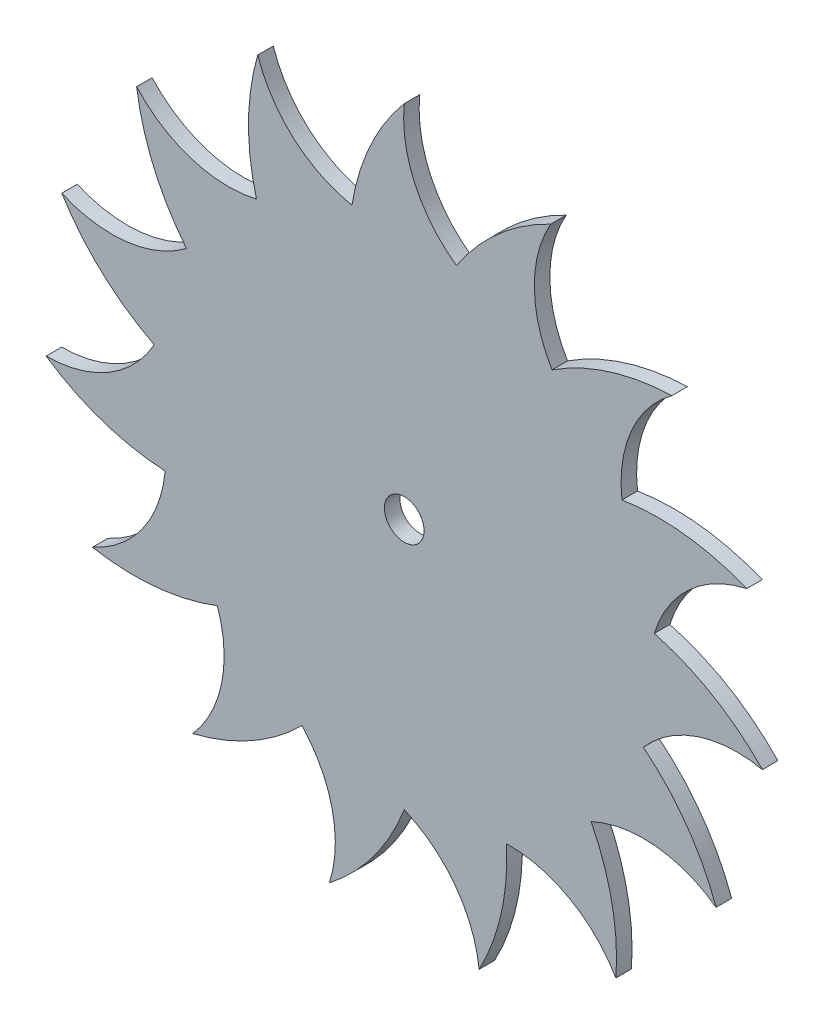
ISO-10303-21;
HEADER;
FILE_DESCRIPTION(('STEP AP214'),'2;1');
FILE_NAME('part.step','',(''),(''),'','','');
FILE_SCHEMA(('AUTOMOTIVE_DESIGN { 1 0 10303 214 1 1 1 1 }'));
ENDSEC;
DATA;
#1=APPLICATION_CONTEXT('core data for automotive mechanical design processes');
#2=APPLICATION_PROTOCOL_DEFINITION('international standard','automotive_design',2000,#1);
#3=PRODUCT_CONTEXT('',#1,'mechanical');
#4=PRODUCT('Part','Part','',(#3));
#5=PRODUCT_RELATED_PRODUCT_CATEGORY('part','',(#4));
#6=PRODUCT_DEFINITION_FORMATION('','',#4);
#7=PRODUCT_DEFINITION_CONTEXT('part definition',#1,'design');
#8=PRODUCT_DEFINITION('design','',#6,#7);
#9=PRODUCT_DEFINITION_SHAPE('','',#8);
#10=(LENGTH_UNIT() NAMED_UNIT(*) SI_UNIT(.MILLI.,.METRE.));
#11=(NAMED_UNIT(*) PLANE_ANGLE_UNIT() SI_UNIT($,.RADIAN.));
#12=(NAMED_UNIT(*) SI_UNIT($,.STERADIAN.) SOLID_ANGLE_UNIT());
#13=UNCERTAINTY_MEASURE_WITH_UNIT(LENGTH_MEASURE(1.E-05),#10,'distance_accuracy_value','');
#14=(GEOMETRIC_REPRESENTATION_CONTEXT(3) GLOBAL_UNCERTAINTY_ASSIGNED_CONTEXT((#13)) GLOBAL_UNIT_ASSIGNED_CONTEXT((#10,
#11,#12)) REPRESENTATION_CONTEXT('',''));
#15=CARTESIAN_POINT('',(0.,0.,0.));
#16=DIRECTION('',(0.,0.,1.));
#17=DIRECTION('',(1.,0.,0.));
#18=AXIS2_PLACEMENT_3D('',#15,#16,#17);
#19=CARTESIAN_POINT('',(161.658373530251,124.492132489692,-30.));
#20=DIRECTION('',(0.,0.,1.));
#21=DIRECTION('',(-1.,0.,0.));
#22=AXIS2_PLACEMENT_3D('',#19,#20,#21);
#23=PLANE('',#22);
#24=CARTESIAN_POINT('',(159.527531281903,76.8009026851546,-30.));
#25=DIRECTION('',(0.,0.,1.));
#26=DIRECTION('',(-1.,0.,0.));
#27=AXIS2_PLACEMENT_3D('',#24,#25,#26);
#28=CIRCLE('',#27,150.);
#29=CARTESIAN_POINT('',(94.3425643614318,211.896868900201,-30.));
#30=VERTEX_POINT('',#29);
#31=CARTESIAN_POINT('',(33.6712983279362,158.41100393884,-30.));
#32=VERTEX_POINT('',#31);
#33=EDGE_CURVE('E462',#30,#32,#28,.T.);
#34=ORIENTED_EDGE('',*,*,#33,.F.);
#35=CARTESIAN_POINT('',(163.789215778599,172.18336229423,-30.));
#36=DIRECTION('',(0.,0.,-1.));
#37=DIRECTION('',(-1.,0.,0.));
#38=AXIS2_PLACEMENT_3D('',#35,#36,#37);
#39=CIRCLE('',#38,80.);
#40=CARTESIAN_POINT('',(95.191821608766,131.020302239023,-30.));
#41=VERTEX_POINT('',#40);
#42=EDGE_CURVE('E279',#41,#30,#39,.T.);
#43=ORIENTED_EDGE('',*,*,#42,.F.);
#44=CARTESIAN_POINT('',(176.973392914872,5.27542323910336,-30.));
#45=DIRECTION('',(0.,0.,1.));
#46=DIRECTION('',(-1.,0.,0.));
#47=AXIS2_PLACEMENT_3D('',#44,#45,#46);
#48=CIRCLE('',#47,150.);
#49=CARTESIAN_POINT('',(172.372442269482,155.204844144937,-30.));
#50=VERTEX_POINT('',#49);
#51=EDGE_CURVE('E258',#50,#41,#48,.T.);
#52=ORIENTED_EDGE('',*,*,#51,.F.);
#53=CARTESIAN_POINT('',(219.662176858442,90.6782527077191,-30.));
#54=DIRECTION('',(0.,0.,-1.));
#55=DIRECTION('',(-1.,0.,0.));
#56=AXIS2_PLACEMENT_3D('',#53,#54,#55);
#57=CIRCLE('',#56,80.);
#58=CARTESIAN_POINT('',(140.25281414289,80.975,-30.));
#59=VERTEX_POINT('',#58);
#60=EDGE_CURVE('E269',#59,#50,#57,.T.);
#61=ORIENTED_EDGE('',*,*,#60,.F.);
#62=CARTESIAN_POINT('',(163.818947160057,-67.1622248107044,-30.));
#63=DIRECTION('',(0.,0.,1.));
#64=DIRECTION('',(-1.,0.,0.));
#65=AXIS2_PLACEMENT_3D('',#62,#63,#64);
#66=CIRCLE('',#65,150.);
#67=CARTESIAN_POINT('',(220.597558954661,71.6764918452691,-30.));
#68=VERTEX_POINT('',#67);
#69=EDGE_CURVE('E275',#68,#59,#66,.T.);
#70=ORIENTED_EDGE('',*,*,#69,.F.);
#71=CARTESIAN_POINT('',(237.553551991232,-6.50595055802087,-30.));
#72=DIRECTION('',(0.,0.,-1.));
#73=DIRECTION('',(-1.,0.,0.));
#74=AXIS2_PLACEMENT_3D('',#71,#72,#73);
#75=CIRCLE('',#74,80.0000000000001);
#76=CARTESIAN_POINT('',(161.062820954892,16.9283846261965,-30.));
#77=VERTEX_POINT('',#76);
#78=EDGE_CURVE('E560',#77,#68,#75,.T.);
#79=ORIENTED_EDGE('',*,*,#78,.F.);
#80=CARTESIAN_POINT('',(122.338717192855,-127.986914041084,-30.));
#81=DIRECTION('',(0.,0.,1.));
#82=DIRECTION('',(-1.,0.,0.));
#83=AXIS2_PLACEMENT_3D('',#80,#81,#82);
#84=CIRCLE('',#83,150.);
#85=CARTESIAN_POINT('',(230.679353630671,-24.2453770549322,-30.));
#86=VERTEX_POINT('',#85);
#87=EDGE_CURVE('E556',#86,#77,#84,.T.);
#88=ORIENTED_EDGE('',*,*,#87,.F.);
#89=CARTESIAN_POINT('',(214.369759878469,-102.565215867574,-30.));
#90=DIRECTION('',(0.,0.,-1.));
#91=DIRECTION('',(-1.,0.,0.));
#92=AXIS2_PLACEMENT_3D('',#89,#90,#91);
#93=CIRCLE('',#92,80.);
#94=CARTESIAN_POINT('',(154.023602814,-50.0453022390227,-30.));
#95=VERTEX_POINT('',#94);
#96=EDGE_CURVE('E552',#95,#86,#93,.T.);
#97=ORIENTED_EDGE('',*,*,#96,.F.);
#98=CARTESIAN_POINT('',(59.7050116106544,-166.681503109148,-30.));
#99=DIRECTION('',(0.,0.,1.));
#100=DIRECTION('',(-1.,0.,0.));
#101=AXIS2_PLACEMENT_3D('',#98,#99,#100);
#102=CIRCLE('',#101,150.);
#103=CARTESIAN_POINT('',(200.874592407801,-115.975,-30.));
#104=VERTEX_POINT('',#103);
#105=EDGE_CURVE('E548',#104,#95,#102,.T.);
#106=ORIENTED_EDGE('',*,*,#105,.F.);
#107=CARTESIAN_POINT('',(154.119488794589,-180.890023577889,-30.));
#108=DIRECTION('',(0.,0.,-1.));
#109=DIRECTION('',(-1.,0.,0.));
#110=AXIS2_PLACEMENT_3D('',#107,#108,#109);
#111=CIRCLE('',#110,80.0000000000001);
#112=CARTESIAN_POINT('',(120.352304486064,-108.365701699817,-30.));
#113=VERTEX_POINT('',#112);
#114=EDGE_CURVE('E544',#113,#104,#111,.T.);
#115=ORIENTED_EDGE('',*,*,#114,.F.);
#116=CARTESIAN_POINT('',(-13.2522328820312,-176.555346035722,-30.));
#117=DIRECTION('',(0.,0.,1.));
#118=DIRECTION('',(-1.,0.,0.));
#119=AXIS2_PLACEMENT_3D('',#116,#117,#118);
#120=CIRCLE('',#119,150.);
#121=CARTESIAN_POINT('',(136.336789269239,-187.651491845269,-30.));
#122=VERTEX_POINT('',#121);
#123=EDGE_CURVE('E540',#122,#113,#120,.T.);
#124=ORIENTED_EDGE('',*,*,#123,.F.);
#125=CARTESIAN_POINT('',(67.2205579665236,-227.937302877313,-30.));
#126=DIRECTION('',(0.,0.,-1.));
#127=DIRECTION('',(-1.,0.,0.));
#128=AXIS2_PLACEMENT_3D('',#125,#126,#127);
#129=CIRCLE('',#128,80.0000000000001);
#130=CARTESIAN_POINT('',(65.8709993461259,-147.948686865219,-30.));
#131=VERTEX_POINT('',#130);
#132=EDGE_CURVE('E536',#131,#122,#129,.T.);
#133=ORIENTED_EDGE('',*,*,#132,.F.);
#134=CARTESIAN_POINT('',(-83.9180459166574,-155.901165677756,-30.));
#135=DIRECTION('',(0.,0.,1.));
#136=DIRECTION('',(-1.,0.,0.));
#137=AXIS2_PLACEMENT_3D('',#134,#135,#136);
#138=CIRCLE('',#137,150.);
#139=CARTESIAN_POINT('',(48.2251166851794,-226.881335990206,-30.));
#140=VERTEX_POINT('',#139);
#141=EDGE_CURVE('E532',#140,#131,#138,.T.);
#142=ORIENTED_EDGE('',*,*,#141,.F.);
#143=CARTESIAN_POINT('',(-31.3014180135512,-235.572151763861,-30.));
#144=DIRECTION('',(0.,0.,-1.));
#145=DIRECTION('',(-1.,0.,0.));
#146=AXIS2_PLACEMENT_3D('',#143,#144,#145);
#147=CIRCLE('',#146,80.);
#148=CARTESIAN_POINT('',(0.,-161.95,-30.));
#149=VERTEX_POINT('',#148);
#150=EDGE_CURVE('E528',#149,#140,#147,.T.);
#151=ORIENTED_EDGE('',*,*,#150,.F.);
#152=CARTESIAN_POINT('',(-140.07366644078,-108.290257456478,-30.));
#153=DIRECTION('',(0.,0.,1.));
#154=DIRECTION('',(-1.,0.,0.));
#155=AXIS2_PLACEMENT_3D('',#152,#153,#154);
#156=CIRCLE('',#155,150.);
#157=CARTESIAN_POINT('',(-48.2251166851792,-226.881335990206,-30.));
#158=VERTEX_POINT('',#157);
#159=EDGE_CURVE('E524',#158,#149,#156,.T.);
#160=ORIENTED_EDGE('',*,*,#159,.F.);
#161=CARTESIAN_POINT('',(-124.411094454628,-202.474435504624,-30.));
#162=DIRECTION('',(0.,0.,-1.));
#163=DIRECTION('',(-1.,0.,0.));
#164=AXIS2_PLACEMENT_3D('',#161,#162,#163);
#165=CIRCLE('',#164,80.);
#166=CARTESIAN_POINT('',(-65.8709993461258,-147.948686865219,-30.));
#167=VERTEX_POINT('',#166);
#168=EDGE_CURVE('E520',#167,#158,#165,.T.);
#169=ORIENTED_EDGE('',*,*,#168,.F.);
#170=CARTESIAN_POINT('',(-172.009277507981,-41.9549799348709,-30.));
#171=DIRECTION('',(0.,0.,1.));
#172=DIRECTION('',(-1.,0.,0.));
#173=AXIS2_PLACEMENT_3D('',#170,#171,#172);
#174=CIRCLE('',#173,150.);
#175=CARTESIAN_POINT('',(-136.336789269239,-187.651491845269,-30.));
#176=VERTEX_POINT('',#175);
#177=EDGE_CURVE('E516',#176,#167,#174,.T.);
#178=ORIENTED_EDGE('',*,*,#177,.F.);
#179=CARTESIAN_POINT('',(-196.008962425188,-134.367049924138,-30.));
#180=DIRECTION('',(0.,0.,-1.));
#181=DIRECTION('',(-1.,0.,0.));
#182=AXIS2_PLACEMENT_3D('',#179,#180,#181);
#183=CIRCLE('',#182,80.0000000000001);
#184=CARTESIAN_POINT('',(-120.352304486064,-108.365701699817,-30.));
#185=VERTEX_POINT('',#184);
#186=EDGE_CURVE('E512',#185,#176,#183,.T.);
#187=ORIENTED_EDGE('',*,*,#186,.F.);
#188=CARTESIAN_POINT('',(-174.202921838824,31.6346947665022,-30.));
#189=DIRECTION('',(0.,0.,1.));
#190=DIRECTION('',(-1.,0.,0.));
#191=AXIS2_PLACEMENT_3D('',#188,#189,#190);
#192=CIRCLE('',#191,150.);
#193=CARTESIAN_POINT('',(-200.8745924078,-115.975,-30.));
#194=VERTEX_POINT('',#193);
#195=EDGE_CURVE('E508',#194,#185,#192,.T.);
#196=ORIENTED_EDGE('',*,*,#195,.F.);
#197=CARTESIAN_POINT('',(-233.715100106912,-43.0263807254408,-30.));
#198=DIRECTION('',(0.,0.,-1.));
#199=DIRECTION('',(-1.,0.,0.));
#200=AXIS2_PLACEMENT_3D('',#197,#198,#199);
#201=CIRCLE('',#200,80.);
#202=CARTESIAN_POINT('',(-154.023602814,-50.0453022390228,-30.));
#203=VERTEX_POINT('',#202);
#204=EDGE_CURVE('E504',#203,#194,#201,.T.);
#205=ORIENTED_EDGE('',*,*,#204,.F.);
#206=CARTESIAN_POINT('',(-146.275298399872,99.7544433505675,-30.));
#207=DIRECTION('',(0.,0.,1.));
#208=DIRECTION('',(-1.,0.,0.));
#209=AXIS2_PLACEMENT_3D('',#206,#207,#208);
#210=CIRCLE('',#209,150.);
#211=CARTESIAN_POINT('',(-230.679353630671,-24.2453770549324,-30.));
#212=VERTEX_POINT('',#211);
#213=EDGE_CURVE('E500',#212,#203,#210,.T.);
#214=ORIENTED_EDGE('',*,*,#213,.F.);
#215=CARTESIAN_POINT('',(-231.009773745122,55.7539405830823,-30.));
#216=DIRECTION('',(0.,0.,-1.));
#217=DIRECTION('',(-1.,0.,0.));
#218=AXIS2_PLACEMENT_3D('',#215,#216,#217);
#219=CIRCLE('',#218,80.);
#220=CARTESIAN_POINT('',(-161.062820954892,16.9283846261964,-30.));
#221=VERTEX_POINT('',#220);
#222=EDGE_CURVE('E496',#221,#212,#219,.T.);
#223=ORIENTED_EDGE('',*,*,#222,.F.);
#224=CARTESIAN_POINT('',(-93.0553469982141,150.625742438652,-30.));
#225=DIRECTION('',(0.,0.,1.));
#226=DIRECTION('',(-1.,0.,0.));
#227=AXIS2_PLACEMENT_3D('',#224,#225,#226);
#228=CIRCLE('',#227,150.);
#229=CARTESIAN_POINT('',(-220.597558954661,71.676491845269,-30.));
#230=VERTEX_POINT('',#229);
#231=EDGE_CURVE('E492',#230,#221,#228,.T.);
#232=ORIENTED_EDGE('',*,*,#231,.F.);
#233=CARTESIAN_POINT('',(-188.360758844891,144.893899056142,-30.));
#234=DIRECTION('',(0.,0.,-1.));
#235=DIRECTION('',(-1.,0.,0.));
#236=AXIS2_PLACEMENT_3D('',#233,#234,#235);
#237=CIRCLE('',#236,80.0000000000001);
#238=CARTESIAN_POINT('',(-140.25281414289,80.975,-30.));
#239=VERTEX_POINT('',#238);
#240=EDGE_CURVE('E488',#239,#230,#237,.T.);
#241=ORIENTED_EDGE('',*,*,#240,.F.);
#242=CARTESIAN_POINT('',(-23.7452807192772,175.452482267182,-30.));
#243=DIRECTION('',(0.,0.,1.));
#244=DIRECTION('',(-1.,0.,0.));
#245=AXIS2_PLACEMENT_3D('',#242,#243,#244);
#246=CIRCLE('',#245,150.);
#247=CARTESIAN_POINT('',(-172.372442269482,155.204844144937,-30.));
#248=VERTEX_POINT('',#247);
#249=EDGE_CURVE('E484',#248,#239,#246,.T.);
#250=ORIENTED_EDGE('',*,*,#249,.F.);
#251=CARTESIAN_POINT('',(-113.142457536605,208.980386062645,-30.));
#252=DIRECTION('',(0.,0.,-1.));
#253=DIRECTION('',(-1.,0.,0.));
#254=AXIS2_PLACEMENT_3D('',#251,#252,#253);
#255=CIRCLE('',#254,80.0000000000001);
#256=CARTESIAN_POINT('',(-95.1918216087661,131.020302239023,-30.));
#257=VERTEX_POINT('',#256);
#258=EDGE_CURVE('E480',#257,#248,#255,.T.);
#259=ORIENTED_EDGE('',*,*,#258,.F.);
#260=CARTESIAN_POINT('',(49.670560315126,169.941893975955,-30.));
#261=DIRECTION('',(0.,0.,1.));
#262=DIRECTION('',(-1.,0.,0.));
#263=AXIS2_PLACEMENT_3D('',#260,#261,#262);
#264=CIRCLE('',#263,150.);
#265=CARTESIAN_POINT('',(-94.342564361432,211.896868900201,-30.));
#266=VERTEX_POINT('',#265);
#267=EDGE_CURVE('E476',#266,#257,#264,.T.);
#268=ORIENTED_EDGE('',*,*,#267,.F.);
#269=CARTESIAN_POINT('',(-18.360797453281,236.932265791711,-30.));
#270=DIRECTION('',(0.,0.,-1.));
#271=DIRECTION('',(-1.,0.,0.));
#272=AXIS2_PLACEMENT_3D('',#269,#270,#271);
#273=CIRCLE('',#272,80.0000000000001);
#274=CARTESIAN_POINT('',(-33.6712983279361,158.41100393884,-30.));
#275=VERTEX_POINT('',#274);
#276=EDGE_CURVE('E472',#275,#266,#273,.T.);
#277=ORIENTED_EDGE('',*,*,#276,.F.);
#278=CARTESIAN_POINT('',(114.49791022817,135.046808342645,-30.));
#279=DIRECTION('',(0.,0.,1.));
#280=DIRECTION('',(-1.,0.,0.));
#281=AXIS2_PLACEMENT_3D('',#278,#279,#280);
#282=CIRCLE('',#281,150.);
#283=CARTESIAN_POINT('',(0.,231.95,-30.));
#284=VERTEX_POINT('',#283);
#285=EDGE_CURVE('E468',#284,#275,#282,.T.);
#286=ORIENTED_EDGE('',*,*,#285,.F.);
#287=CARTESIAN_POINT('',(79.5956113123232,223.916404303329,-30.));
#288=DIRECTION('',(0.,0.,-1.));
#289=DIRECTION('',(-1.,0.,0.));
#290=AXIS2_PLACEMENT_3D('',#287,#288,#289);
#291=CIRCLE('',#290,80.);
#292=EDGE_CURVE('E465',#32,#284,#291,.T.);
#293=ORIENTED_EDGE('',*,*,#292,.F.);
#294=EDGE_LOOP('',(#34,#43,#52,#61,#70,#79,#88,#97,#106,#115,#124,#133,#142,#151,#160,#169,#178,
#187,#196,#205,#214,#223,#232,#241,#250,#259,#268,#277,#286,#293));
#295=FACE_BOUND('',#294,.T.);
#296=CARTESIAN_POINT('',(0.,0.,-30.));
#297=DIRECTION('',(0.,0.,1.));
#298=DIRECTION('',(1.,0.,0.));
#299=AXIS2_PLACEMENT_3D('',#296,#297,#298);
#300=CIRCLE('',#299,12.75);
#301=CARTESIAN_POINT('',(12.75,0.,-30.));
#302=VERTEX_POINT('',#301);
#303=EDGE_CURVE('E293',#302,#302,#300,.T.);
#304=ORIENTED_EDGE('',*,*,#303,.T.);
#305=EDGE_LOOP('',(#304));
#306=FACE_BOUND('',#305,.T.);
#307=ADVANCED_FACE('F52',(#295,#306),#23,.F.);
#308=CARTESIAN_POINT('',(161.658373530251,124.492132489692,-20.));
#309=DIRECTION('',(0.,0.,1.));
#310=DIRECTION('',(-1.,0.,0.));
#311=AXIS2_PLACEMENT_3D('',#308,#309,#310);
#312=PLANE('',#311);
#313=CARTESIAN_POINT('',(159.527531281903,76.8009026851546,-20.));
#314=DIRECTION('',(0.,0.,1.));
#315=DIRECTION('',(-1.,0.,0.));
#316=AXIS2_PLACEMENT_3D('',#313,#314,#315);
#317=CIRCLE('',#316,150.);
#318=CARTESIAN_POINT('',(94.3425643614318,211.896868900201,-20.));
#319=VERTEX_POINT('',#318);
#320=CARTESIAN_POINT('',(33.6712983279362,158.41100393884,-20.));
#321=VERTEX_POINT('',#320);
#322=EDGE_CURVE('E287',#319,#321,#317,.T.);
#323=ORIENTED_EDGE('',*,*,#322,.T.);
#324=CARTESIAN_POINT('',(79.5956113123232,223.916404303329,-20.));
#325=DIRECTION('',(0.,0.,-1.));
#326=DIRECTION('',(-1.,0.,0.));
#327=AXIS2_PLACEMENT_3D('',#324,#325,#326);
#328=CIRCLE('',#327,80.);
#329=CARTESIAN_POINT('',(0.,231.95,-20.));
#330=VERTEX_POINT('',#329);
#331=EDGE_CURVE('E292',#321,#330,#328,.T.);
#332=ORIENTED_EDGE('',*,*,#331,.T.);
#333=CARTESIAN_POINT('',(114.49791022817,135.046808342645,-20.));
#334=DIRECTION('',(0.,0.,1.));
#335=DIRECTION('',(-1.,0.,0.));
#336=AXIS2_PLACEMENT_3D('',#333,#334,#335);
#337=CIRCLE('',#336,150.);
#338=CARTESIAN_POINT('',(-33.6712983279361,158.41100393884,-20.));
#339=VERTEX_POINT('',#338);
#340=EDGE_CURVE('E302',#330,#339,#337,.T.);
#341=ORIENTED_EDGE('',*,*,#340,.T.);
#342=CARTESIAN_POINT('',(-18.360797453281,236.932265791711,-20.));
#343=DIRECTION('',(0.,0.,-1.));
#344=DIRECTION('',(-1.,0.,0.));
#345=AXIS2_PLACEMENT_3D('',#342,#343,#344);
#346=CIRCLE('',#345,80.0000000000001);
#347=CARTESIAN_POINT('',(-94.342564361432,211.896868900201,-20.));
#348=VERTEX_POINT('',#347);
#349=EDGE_CURVE('E306',#339,#348,#346,.T.);
#350=ORIENTED_EDGE('',*,*,#349,.T.);
#351=CARTESIAN_POINT('',(49.670560315126,169.941893975955,-20.));
#352=DIRECTION('',(0.,0.,1.));
#353=DIRECTION('',(-1.,0.,0.));
#354=AXIS2_PLACEMENT_3D('',#351,#352,#353);
#355=CIRCLE('',#354,150.);
#356=CARTESIAN_POINT('',(-95.1918216087661,131.020302239023,-20.));
#357=VERTEX_POINT('',#356);
#358=EDGE_CURVE('E311',#348,#357,#355,.T.);
#359=ORIENTED_EDGE('',*,*,#358,.T.);
#360=CARTESIAN_POINT('',(-113.142457536605,208.980386062645,-20.));
#361=DIRECTION('',(0.,0.,-1.));
#362=DIRECTION('',(-1.,0.,0.));
#363=AXIS2_PLACEMENT_3D('',#360,#361,#362);
#364=CIRCLE('',#363,80.0000000000001);
#365=CARTESIAN_POINT('',(-172.372442269482,155.204844144937,-20.));
#366=VERTEX_POINT('',#365);
#367=EDGE_CURVE('E316',#357,#366,#364,.T.);
#368=ORIENTED_EDGE('',*,*,#367,.T.);
#369=CARTESIAN_POINT('',(-23.7452807192772,175.452482267182,-20.));
#370=DIRECTION('',(0.,0.,1.));
#371=DIRECTION('',(-1.,0.,0.));
#372=AXIS2_PLACEMENT_3D('',#369,#370,#371);
#373=CIRCLE('',#372,150.);
#374=CARTESIAN_POINT('',(-140.25281414289,80.975,-20.));
#375=VERTEX_POINT('',#374);
#376=EDGE_CURVE('E324',#366,#375,#373,.T.);
#377=ORIENTED_EDGE('',*,*,#376,.T.);
#378=CARTESIAN_POINT('',(-188.360758844891,144.893899056142,-20.));
#379=DIRECTION('',(0.,0.,-1.));
#380=DIRECTION('',(-1.,0.,0.));
#381=AXIS2_PLACEMENT_3D('',#378,#379,#380);
#382=CIRCLE('',#381,80.0000000000001);
#383=CARTESIAN_POINT('',(-220.597558954661,71.676491845269,-20.));
#384=VERTEX_POINT('',#383);
#385=EDGE_CURVE('E328',#375,#384,#382,.T.);
#386=ORIENTED_EDGE('',*,*,#385,.T.);
#387=CARTESIAN_POINT('',(-93.0553469982141,150.625742438652,-20.));
#388=DIRECTION('',(0.,0.,1.));
#389=DIRECTION('',(-1.,0.,0.));
#390=AXIS2_PLACEMENT_3D('',#387,#388,#389);
#391=CIRCLE('',#390,150.);
#392=CARTESIAN_POINT('',(-161.062820954892,16.9283846261964,-20.));
#393=VERTEX_POINT('',#392);
#394=EDGE_CURVE('E333',#384,#393,#391,.T.);
#395=ORIENTED_EDGE('',*,*,#394,.T.);
#396=CARTESIAN_POINT('',(-231.009773745122,55.7539405830823,-20.));
#397=DIRECTION('',(0.,0.,-1.));
#398=DIRECTION('',(-1.,0.,0.));
#399=AXIS2_PLACEMENT_3D('',#396,#397,#398);
#400=CIRCLE('',#399,80.);
#401=CARTESIAN_POINT('',(-230.679353630671,-24.2453770549324,-20.));
#402=VERTEX_POINT('',#401);
#403=EDGE_CURVE('E338',#393,#402,#400,.T.);
#404=ORIENTED_EDGE('',*,*,#403,.T.);
#405=CARTESIAN_POINT('',(-146.275298399872,99.7544433505675,-20.));
#406=DIRECTION('',(0.,0.,1.));
#407=DIRECTION('',(-1.,0.,0.));
#408=AXIS2_PLACEMENT_3D('',#405,#406,#407);
#409=CIRCLE('',#408,150.);
#410=CARTESIAN_POINT('',(-154.023602814,-50.0453022390228,-20.));
#411=VERTEX_POINT('',#410);
#412=EDGE_CURVE('E346',#402,#411,#409,.T.);
#413=ORIENTED_EDGE('',*,*,#412,.T.);
#414=CARTESIAN_POINT('',(-233.715100106912,-43.0263807254408,-20.));
#415=DIRECTION('',(0.,0.,-1.));
#416=DIRECTION('',(-1.,0.,0.));
#417=AXIS2_PLACEMENT_3D('',#414,#415,#416);
#418=CIRCLE('',#417,80.);
#419=CARTESIAN_POINT('',(-200.8745924078,-115.975,-20.));
#420=VERTEX_POINT('',#419);
#421=EDGE_CURVE('E350',#411,#420,#418,.T.);
#422=ORIENTED_EDGE('',*,*,#421,.T.);
#423=CARTESIAN_POINT('',(-174.202921838824,31.6346947665022,-20.));
#424=DIRECTION('',(0.,0.,1.));
#425=DIRECTION('',(-1.,0.,0.));
#426=AXIS2_PLACEMENT_3D('',#423,#424,#425);
#427=CIRCLE('',#426,150.);
#428=CARTESIAN_POINT('',(-120.352304486064,-108.365701699817,-20.));
#429=VERTEX_POINT('',#428);
#430=EDGE_CURVE('E355',#420,#429,#427,.T.);
#431=ORIENTED_EDGE('',*,*,#430,.T.);
#432=CARTESIAN_POINT('',(-196.008962425188,-134.367049924138,-20.));
#433=DIRECTION('',(0.,0.,-1.));
#434=DIRECTION('',(-1.,0.,0.));
#435=AXIS2_PLACEMENT_3D('',#432,#433,#434);
#436=CIRCLE('',#435,80.0000000000001);
#437=CARTESIAN_POINT('',(-136.336789269239,-187.651491845269,-20.));
#438=VERTEX_POINT('',#437);
#439=EDGE_CURVE('E360',#429,#438,#436,.T.);
#440=ORIENTED_EDGE('',*,*,#439,.T.);
#441=CARTESIAN_POINT('',(-172.009277507981,-41.9549799348709,-20.));
#442=DIRECTION('',(0.,0.,1.));
#443=DIRECTION('',(-1.,0.,0.));
#444=AXIS2_PLACEMENT_3D('',#441,#442,#443);
#445=CIRCLE('',#444,150.);
#446=CARTESIAN_POINT('',(-65.8709993461258,-147.948686865219,-20.));
#447=VERTEX_POINT('',#446);
#448=EDGE_CURVE('E368',#438,#447,#445,.T.);
#449=ORIENTED_EDGE('',*,*,#448,.T.);
#450=CARTESIAN_POINT('',(-124.411094454628,-202.474435504624,-20.));
#451=DIRECTION('',(0.,0.,-1.));
#452=DIRECTION('',(-1.,0.,0.));
#453=AXIS2_PLACEMENT_3D('',#450,#451,#452);
#454=CIRCLE('',#453,80.);
#455=CARTESIAN_POINT('',(-48.2251166851792,-226.881335990206,-20.));
#456=VERTEX_POINT('',#455);
#457=EDGE_CURVE('E372',#447,#456,#454,.T.);
#458=ORIENTED_EDGE('',*,*,#457,.T.);
#459=CARTESIAN_POINT('',(-140.07366644078,-108.290257456478,-20.));
#460=DIRECTION('',(0.,0.,1.));
#461=DIRECTION('',(-1.,0.,0.));
#462=AXIS2_PLACEMENT_3D('',#459,#460,#461);
#463=CIRCLE('',#462,150.);
#464=CARTESIAN_POINT('',(0.,-161.95,-20.));
#465=VERTEX_POINT('',#464);
#466=EDGE_CURVE('E377',#456,#465,#463,.T.);
#467=ORIENTED_EDGE('',*,*,#466,.T.);
#468=CARTESIAN_POINT('',(-31.3014180135512,-235.572151763861,-20.));
#469=DIRECTION('',(0.,0.,-1.));
#470=DIRECTION('',(-1.,0.,0.));
#471=AXIS2_PLACEMENT_3D('',#468,#469,#470);
#472=CIRCLE('',#471,80.);
#473=CARTESIAN_POINT('',(48.2251166851794,-226.881335990206,-20.));
#474=VERTEX_POINT('',#473);
#475=EDGE_CURVE('E382',#465,#474,#472,.T.);
#476=ORIENTED_EDGE('',*,*,#475,.T.);
#477=CARTESIAN_POINT('',(-83.9180459166574,-155.901165677756,-20.));
#478=DIRECTION('',(0.,0.,1.));
#479=DIRECTION('',(-1.,0.,0.));
#480=AXIS2_PLACEMENT_3D('',#477,#478,#479);
#481=CIRCLE('',#480,150.);
#482=CARTESIAN_POINT('',(65.8709993461259,-147.948686865219,-20.));
#483=VERTEX_POINT('',#482);
#484=EDGE_CURVE('E390',#474,#483,#481,.T.);
#485=ORIENTED_EDGE('',*,*,#484,.T.);
#486=CARTESIAN_POINT('',(67.2205579665236,-227.937302877313,-20.));
#487=DIRECTION('',(0.,0.,-1.));
#488=DIRECTION('',(-1.,0.,0.));
#489=AXIS2_PLACEMENT_3D('',#486,#487,#488);
#490=CIRCLE('',#489,80.0000000000001);
#491=CARTESIAN_POINT('',(136.336789269239,-187.651491845269,-20.));
#492=VERTEX_POINT('',#491);
#493=EDGE_CURVE('E394',#483,#492,#490,.T.);
#494=ORIENTED_EDGE('',*,*,#493,.T.);
#495=CARTESIAN_POINT('',(-13.2522328820312,-176.555346035722,-20.));
#496=DIRECTION('',(0.,0.,1.));
#497=DIRECTION('',(-1.,0.,0.));
#498=AXIS2_PLACEMENT_3D('',#495,#496,#497);
#499=CIRCLE('',#498,150.);
#500=CARTESIAN_POINT('',(120.352304486064,-108.365701699817,-20.));
#501=VERTEX_POINT('',#500);
#502=EDGE_CURVE('E399',#492,#501,#499,.T.);
#503=ORIENTED_EDGE('',*,*,#502,.T.);
#504=CARTESIAN_POINT('',(154.119488794589,-180.890023577889,-20.));
#505=DIRECTION('',(0.,0.,-1.));
#506=DIRECTION('',(-1.,0.,0.));
#507=AXIS2_PLACEMENT_3D('',#504,#505,#506);
#508=CIRCLE('',#507,80.0000000000001);
#509=CARTESIAN_POINT('',(200.874592407801,-115.975,-20.));
#510=VERTEX_POINT('',#509);
#511=EDGE_CURVE('E404',#501,#510,#508,.T.);
#512=ORIENTED_EDGE('',*,*,#511,.T.);
#513=CARTESIAN_POINT('',(59.7050116106544,-166.681503109148,-20.));
#514=DIRECTION('',(0.,0.,1.));
#515=DIRECTION('',(-1.,0.,0.));
#516=AXIS2_PLACEMENT_3D('',#513,#514,#515);
#517=CIRCLE('',#516,150.);
#518=CARTESIAN_POINT('',(154.023602814,-50.0453022390227,-20.));
#519=VERTEX_POINT('',#518);
#520=EDGE_CURVE('E412',#510,#519,#517,.T.);
#521=ORIENTED_EDGE('',*,*,#520,.T.);
#522=CARTESIAN_POINT('',(214.369759878469,-102.565215867574,-20.));
#523=DIRECTION('',(0.,0.,-1.));
#524=DIRECTION('',(-1.,0.,0.));
#525=AXIS2_PLACEMENT_3D('',#522,#523,#524);
#526=CIRCLE('',#525,80.);
#527=CARTESIAN_POINT('',(230.679353630671,-24.2453770549322,-20.));
#528=VERTEX_POINT('',#527);
#529=EDGE_CURVE('E416',#519,#528,#526,.T.);
#530=ORIENTED_EDGE('',*,*,#529,.T.);
#531=CARTESIAN_POINT('',(122.338717192855,-127.986914041084,-20.));
#532=DIRECTION('',(0.,0.,1.));
#533=DIRECTION('',(-1.,0.,0.));
#534=AXIS2_PLACEMENT_3D('',#531,#532,#533);
#535=CIRCLE('',#534,150.);
#536=CARTESIAN_POINT('',(161.062820954892,16.9283846261965,-20.));
#537=VERTEX_POINT('',#536);
#538=EDGE_CURVE('E421',#528,#537,#535,.T.);
#539=ORIENTED_EDGE('',*,*,#538,.T.);
#540=CARTESIAN_POINT('',(237.553551991232,-6.50595055802087,-20.));
#541=DIRECTION('',(0.,0.,-1.));
#542=DIRECTION('',(-1.,0.,0.));
#543=AXIS2_PLACEMENT_3D('',#540,#541,#542);
#544=CIRCLE('',#543,80.0000000000001);
#545=CARTESIAN_POINT('',(220.597558954661,71.6764918452691,-20.));
#546=VERTEX_POINT('',#545);
#547=EDGE_CURVE('E426',#537,#546,#544,.T.);
#548=ORIENTED_EDGE('',*,*,#547,.T.);
#549=CARTESIAN_POINT('',(163.818947160057,-67.1622248107044,-20.));
#550=DIRECTION('',(0.,0.,1.));
#551=DIRECTION('',(-1.,0.,0.));
#552=AXIS2_PLACEMENT_3D('',#549,#550,#551);
#553=CIRCLE('',#552,150.);
#554=CARTESIAN_POINT('',(140.25281414289,80.975,-20.));
#555=VERTEX_POINT('',#554);
#556=EDGE_CURVE('E434',#546,#555,#553,.T.);
#557=ORIENTED_EDGE('',*,*,#556,.T.);
#558=CARTESIAN_POINT('',(219.662176858442,90.6782527077191,-20.));
#559=DIRECTION('',(0.,0.,-1.));
#560=DIRECTION('',(-1.,0.,0.));
#561=AXIS2_PLACEMENT_3D('',#558,#559,#560);
#562=CIRCLE('',#561,80.);
#563=CARTESIAN_POINT('',(172.372442269482,155.204844144937,-20.));
#564=VERTEX_POINT('',#563);
#565=EDGE_CURVE('E438',#555,#564,#562,.T.);
#566=ORIENTED_EDGE('',*,*,#565,.T.);
#567=CARTESIAN_POINT('',(176.973392914872,5.27542323910336,-20.));
#568=DIRECTION('',(0.,0.,1.));
#569=DIRECTION('',(-1.,0.,0.));
#570=AXIS2_PLACEMENT_3D('',#567,#568,#569);
#571=CIRCLE('',#570,150.);
#572=CARTESIAN_POINT('',(95.191821608766,131.020302239023,-20.));
#573=VERTEX_POINT('',#572);
#574=EDGE_CURVE('E261',#564,#573,#571,.T.);
#575=ORIENTED_EDGE('',*,*,#574,.T.);
#576=CARTESIAN_POINT('',(163.789215778599,172.18336229423,-20.));
#577=DIRECTION('',(0.,0.,-1.));
#578=DIRECTION('',(-1.,0.,0.));
#579=AXIS2_PLACEMENT_3D('',#576,#577,#578);
#580=CIRCLE('',#579,80.);
#581=EDGE_CURVE('E445',#573,#319,#580,.T.);
#582=ORIENTED_EDGE('',*,*,#581,.T.);
#583=EDGE_LOOP('',(#323,#332,#341,#350,#359,#368,#377,#386,#395,#404,#413,#422,#431,#440,#449,
#458,#467,#476,#485,#494,#503,#512,#521,#530,#539,#548,#557,#566,#575,#582));
#584=FACE_BOUND('',#583,.T.);
#585=CARTESIAN_POINT('',(0.,0.,-20.));
#586=DIRECTION('',(0.,0.,1.));
#587=DIRECTION('',(1.,0.,0.));
#588=AXIS2_PLACEMENT_3D('',#585,#586,#587);
#589=CIRCLE('',#588,12.75);
#590=CARTESIAN_POINT('',(12.75,0.,-20.));
#591=VERTEX_POINT('',#590);
#592=EDGE_CURVE('E456',#591,#591,#589,.T.);
#593=ORIENTED_EDGE('',*,*,#592,.F.);
#594=EDGE_LOOP('',(#593));
#595=FACE_BOUND('',#594,.T.);
#596=ADVANCED_FACE('F730',(#584,#595),#312,.T.);
#597=CARTESIAN_POINT('',(159.527531281903,76.8009026851546,-30.));
#598=DIRECTION('',(0.,0.,1.));
#599=DIRECTION('',(-1.,0.,0.));
#600=AXIS2_PLACEMENT_3D('',#597,#598,#599);
#601=CYLINDRICAL_SURFACE('',#600,150.);
#602=ORIENTED_EDGE('',*,*,#322,.F.);
#603=DIRECTION('',(0.,0.,1.));
#604=VECTOR('',#603,1.);
#605=CARTESIAN_POINT('',(94.3425643614318,211.896868900201,-30.));
#606=LINE('',#605,#604);
#607=EDGE_CURVE('E70',#30,#319,#606,.T.);
#608=ORIENTED_EDGE('',*,*,#607,.F.);
#609=ORIENTED_EDGE('',*,*,#33,.T.);
#610=DIRECTION('',(0.,0.,1.));
#611=VECTOR('',#610,1.);
#612=CARTESIAN_POINT('',(33.6712983279362,158.41100393884,-30.));
#613=LINE('',#612,#611);
#614=EDGE_CURVE('E13',#32,#321,#613,.T.);
#615=ORIENTED_EDGE('',*,*,#614,.T.);
#616=EDGE_LOOP('',(#602,#608,#609,#615));
#617=FACE_BOUND('',#616,.T.);
#618=ADVANCED_FACE('F54',(#617),#601,.T.);
#619=CARTESIAN_POINT('',(79.5956113123232,223.916404303329,-30.));
#620=DIRECTION('',(0.,0.,1.));
#621=DIRECTION('',(-1.,0.,0.));
#622=AXIS2_PLACEMENT_3D('',#619,#620,#621);
#623=CYLINDRICAL_SURFACE('',#622,80.);
#624=ORIENTED_EDGE('',*,*,#331,.F.);
#625=ORIENTED_EDGE('',*,*,#614,.F.);
#626=ORIENTED_EDGE('',*,*,#292,.T.);
#627=DIRECTION('',(0.,0.,1.));
#628=VECTOR('',#627,1.);
#629=CARTESIAN_POINT('',(0.,231.95,-30.));
#630=LINE('',#629,#628);
#631=EDGE_CURVE('E62',#284,#330,#630,.T.);
#632=ORIENTED_EDGE('',*,*,#631,.T.);
#633=EDGE_LOOP('',(#624,#625,#626,#632));
#634=FACE_BOUND('',#633,.T.);
#635=ADVANCED_FACE('F727',(#634),#623,.F.);
#636=CARTESIAN_POINT('',(114.49791022817,135.046808342645,-30.));
#637=DIRECTION('',(0.,0.,1.));
#638=DIRECTION('',(-1.,0.,0.));
#639=AXIS2_PLACEMENT_3D('',#636,#637,#638);
#640=CYLINDRICAL_SURFACE('',#639,150.);
#641=ORIENTED_EDGE('',*,*,#340,.F.);
#642=ORIENTED_EDGE('',*,*,#631,.F.);
#643=ORIENTED_EDGE('',*,*,#285,.T.);
#644=DIRECTION('',(0.,0.,1.));
#645=VECTOR('',#644,1.);
#646=CARTESIAN_POINT('',(-33.6712983279361,158.41100393884,-30.));
#647=LINE('',#646,#645);
#648=EDGE_CURVE('E718',#275,#339,#647,.T.);
#649=ORIENTED_EDGE('',*,*,#648,.T.);
#650=EDGE_LOOP('',(#641,#642,#643,#649));
#651=FACE_BOUND('',#650,.T.);
#652=ADVANCED_FACE('F725',(#651),#640,.T.);
#653=CARTESIAN_POINT('',(-18.360797453281,236.932265791711,-30.));
#654=DIRECTION('',(0.,0.,1.));
#655=DIRECTION('',(-1.,0.,0.));
#656=AXIS2_PLACEMENT_3D('',#653,#654,#655);
#657=CYLINDRICAL_SURFACE('',#656,80.0000000000001);
#658=ORIENTED_EDGE('',*,*,#349,.F.);
#659=ORIENTED_EDGE('',*,*,#648,.F.);
#660=ORIENTED_EDGE('',*,*,#276,.T.);
#661=DIRECTION('',(0.,0.,1.));
#662=VECTOR('',#661,1.);
#663=CARTESIAN_POINT('',(-94.342564361432,211.896868900201,-30.));
#664=LINE('',#663,#662);
#665=EDGE_CURVE('E714',#266,#348,#664,.T.);
#666=ORIENTED_EDGE('',*,*,#665,.T.);
#667=EDGE_LOOP('',(#658,#659,#660,#666));
#668=FACE_BOUND('',#667,.T.);
#669=ADVANCED_FACE('F720',(#668),#657,.F.);
#670=CARTESIAN_POINT('',(49.670560315126,169.941893975955,-30.));
#671=DIRECTION('',(0.,0.,1.));
#672=DIRECTION('',(-1.,0.,0.));
#673=AXIS2_PLACEMENT_3D('',#670,#671,#672);
#674=CYLINDRICAL_SURFACE('',#673,150.);
#675=ORIENTED_EDGE('',*,*,#358,.F.);
#676=ORIENTED_EDGE('',*,*,#665,.F.);
#677=ORIENTED_EDGE('',*,*,#267,.T.);
#678=DIRECTION('',(0.,0.,1.));
#679=VECTOR('',#678,1.);
#680=CARTESIAN_POINT('',(-95.1918216087661,131.020302239023,-30.));
#681=LINE('',#680,#679);
#682=EDGE_CURVE('E705',#257,#357,#681,.T.);
#683=ORIENTED_EDGE('',*,*,#682,.T.);
#684=EDGE_LOOP('',(#675,#676,#677,#683));
#685=FACE_BOUND('',#684,.T.);
#686=ADVANCED_FACE('F713',(#685),#674,.T.);
#687=CARTESIAN_POINT('',(-113.142457536605,208.980386062645,-30.));
#688=DIRECTION('',(0.,0.,1.));
#689=DIRECTION('',(-1.,0.,0.));
#690=AXIS2_PLACEMENT_3D('',#687,#688,#689);
#691=CYLINDRICAL_SURFACE('',#690,80.0000000000001);
#692=ORIENTED_EDGE('',*,*,#367,.F.);
#693=ORIENTED_EDGE('',*,*,#682,.F.);
#694=ORIENTED_EDGE('',*,*,#258,.T.);
#695=DIRECTION('',(0.,0.,1.));
#696=VECTOR('',#695,1.);
#697=CARTESIAN_POINT('',(-172.372442269482,155.204844144937,-30.));
#698=LINE('',#697,#696);
#699=EDGE_CURVE('E698',#248,#366,#698,.T.);
#700=ORIENTED_EDGE('',*,*,#699,.T.);
#701=EDGE_LOOP('',(#692,#693,#694,#700));
#702=FACE_BOUND('',#701,.T.);
#703=ADVANCED_FACE('F707',(#702),#691,.F.);
#704=CARTESIAN_POINT('',(-23.7452807192772,175.452482267182,-30.));
#705=DIRECTION('',(0.,0.,1.));
#706=DIRECTION('',(-1.,0.,0.));
#707=AXIS2_PLACEMENT_3D('',#704,#705,#706);
#708=CYLINDRICAL_SURFACE('',#707,150.);
#709=ORIENTED_EDGE('',*,*,#376,.F.);
#710=ORIENTED_EDGE('',*,*,#699,.F.);
#711=ORIENTED_EDGE('',*,*,#249,.T.);
#712=DIRECTION('',(0.,0.,1.));
#713=VECTOR('',#712,1.);
#714=CARTESIAN_POINT('',(-140.25281414289,80.975,-30.));
#715=LINE('',#714,#713);
#716=EDGE_CURVE('E694',#239,#375,#715,.T.);
#717=ORIENTED_EDGE('',*,*,#716,.T.);
#718=EDGE_LOOP('',(#709,#710,#711,#717));
#719=FACE_BOUND('',#718,.T.);
#720=ADVANCED_FACE('F700',(#719),#708,.T.);
#721=CARTESIAN_POINT('',(-188.360758844891,144.893899056142,-30.));
#722=DIRECTION('',(0.,0.,1.));
#723=DIRECTION('',(-1.,0.,0.));
#724=AXIS2_PLACEMENT_3D('',#721,#722,#723);
#725=CYLINDRICAL_SURFACE('',#724,80.0000000000001);
#726=ORIENTED_EDGE('',*,*,#385,.F.);
#727=ORIENTED_EDGE('',*,*,#716,.F.);
#728=ORIENTED_EDGE('',*,*,#240,.T.);
#729=DIRECTION('',(0.,0.,1.));
#730=VECTOR('',#729,1.);
#731=CARTESIAN_POINT('',(-220.597558954661,71.676491845269,-30.));
#732=LINE('',#731,#730);
#733=EDGE_CURVE('E685',#230,#384,#732,.T.);
#734=ORIENTED_EDGE('',*,*,#733,.T.);
#735=EDGE_LOOP('',(#726,#727,#728,#734));
#736=FACE_BOUND('',#735,.T.);
#737=ADVANCED_FACE('F693',(#736),#725,.F.);
#738=CARTESIAN_POINT('',(-93.0553469982141,150.625742438652,-30.));
#739=DIRECTION('',(0.,0.,1.));
#740=DIRECTION('',(-1.,0.,0.));
#741=AXIS2_PLACEMENT_3D('',#738,#739,#740);
#742=CYLINDRICAL_SURFACE('',#741,150.);
#743=ORIENTED_EDGE('',*,*,#394,.F.);
#744=ORIENTED_EDGE('',*,*,#733,.F.);
#745=ORIENTED_EDGE('',*,*,#231,.T.);
#746=DIRECTION('',(0.,0.,1.));
#747=VECTOR('',#746,1.);
#748=CARTESIAN_POINT('',(-161.062820954892,16.9283846261964,-30.));
#749=LINE('',#748,#747);
#750=EDGE_CURVE('E679',#221,#393,#749,.T.);
#751=ORIENTED_EDGE('',*,*,#750,.T.);
#752=EDGE_LOOP('',(#743,#744,#745,#751));
#753=FACE_BOUND('',#752,.T.);
#754=ADVANCED_FACE('F687',(#753),#742,.T.);
#755=CARTESIAN_POINT('',(-231.009773745122,55.7539405830823,-30.));
#756=DIRECTION('',(0.,0.,1.));
#757=DIRECTION('',(-1.,0.,0.));
#758=AXIS2_PLACEMENT_3D('',#755,#756,#757);
#759=CYLINDRICAL_SURFACE('',#758,80.);
#760=ORIENTED_EDGE('',*,*,#403,.F.);
#761=ORIENTED_EDGE('',*,*,#750,.F.);
#762=ORIENTED_EDGE('',*,*,#222,.T.);
#763=DIRECTION('',(0.,0.,1.));
#764=VECTOR('',#763,1.);
#765=CARTESIAN_POINT('',(-230.679353630671,-24.2453770549324,-30.));
#766=LINE('',#765,#764);
#767=EDGE_CURVE('E674',#212,#402,#766,.T.);
#768=ORIENTED_EDGE('',*,*,#767,.T.);
#769=EDGE_LOOP('',(#760,#761,#762,#768));
#770=FACE_BOUND('',#769,.T.);
#771=ADVANCED_FACE('F681',(#770),#759,.F.);
#772=CARTESIAN_POINT('',(-146.275298399872,99.7544433505675,-30.));
#773=DIRECTION('',(0.,0.,1.));
#774=DIRECTION('',(-1.,0.,0.));
#775=AXIS2_PLACEMENT_3D('',#772,#773,#774);
#776=CYLINDRICAL_SURFACE('',#775,150.);
#777=ORIENTED_EDGE('',*,*,#412,.F.);
#778=ORIENTED_EDGE('',*,*,#767,.F.);
#779=ORIENTED_EDGE('',*,*,#213,.T.);
#780=DIRECTION('',(0.,0.,1.));
#781=VECTOR('',#780,1.);
#782=CARTESIAN_POINT('',(-154.023602814,-50.0453022390228,-30.));
#783=LINE('',#782,#781);
#784=EDGE_CURVE('E665',#203,#411,#783,.T.);
#785=ORIENTED_EDGE('',*,*,#784,.T.);
#786=EDGE_LOOP('',(#777,#778,#779,#785));
#787=FACE_BOUND('',#786,.T.);
#788=ADVANCED_FACE('F673',(#787),#776,.T.);
#789=CARTESIAN_POINT('',(-233.715100106912,-43.0263807254408,-30.));
#790=DIRECTION('',(0.,0.,1.));
#791=DIRECTION('',(-1.,0.,0.));
#792=AXIS2_PLACEMENT_3D('',#789,#790,#791);
#793=CYLINDRICAL_SURFACE('',#792,80.);
#794=ORIENTED_EDGE('',*,*,#421,.F.);
#795=ORIENTED_EDGE('',*,*,#784,.F.);
#796=ORIENTED_EDGE('',*,*,#204,.T.);
#797=DIRECTION('',(0.,0.,1.));
#798=VECTOR('',#797,1.);
#799=CARTESIAN_POINT('',(-200.8745924078,-115.975,-30.));
#800=LINE('',#799,#798);
#801=EDGE_CURVE('E659',#194,#420,#800,.T.);
#802=ORIENTED_EDGE('',*,*,#801,.T.);
#803=EDGE_LOOP('',(#794,#795,#796,#802));
#804=FACE_BOUND('',#803,.T.);
#805=ADVANCED_FACE('F667',(#804),#793,.F.);
#806=CARTESIAN_POINT('',(-174.202921838824,31.6346947665022,-30.));
#807=DIRECTION('',(0.,0.,1.));
#808=DIRECTION('',(-1.,0.,0.));
#809=AXIS2_PLACEMENT_3D('',#806,#807,#808);
#810=CYLINDRICAL_SURFACE('',#809,150.);
#811=ORIENTED_EDGE('',*,*,#430,.F.);
#812=ORIENTED_EDGE('',*,*,#801,.F.);
#813=ORIENTED_EDGE('',*,*,#195,.T.);
#814=DIRECTION('',(0.,0.,1.));
#815=VECTOR('',#814,1.);
#816=CARTESIAN_POINT('',(-120.352304486064,-108.365701699817,-30.));
#817=LINE('',#816,#815);
#818=EDGE_CURVE('E654',#185,#429,#817,.T.);
#819=ORIENTED_EDGE('',*,*,#818,.T.);
#820=EDGE_LOOP('',(#811,#812,#813,#819));
#821=FACE_BOUND('',#820,.T.);
#822=ADVANCED_FACE('F661',(#821),#810,.T.);
#823=CARTESIAN_POINT('',(-196.008962425188,-134.367049924138,-30.));
#824=DIRECTION('',(0.,0.,1.));
#825=DIRECTION('',(-1.,0.,0.));
#826=AXIS2_PLACEMENT_3D('',#823,#824,#825);
#827=CYLINDRICAL_SURFACE('',#826,80.0000000000001);
#828=ORIENTED_EDGE('',*,*,#439,.F.);
#829=ORIENTED_EDGE('',*,*,#818,.F.);
#830=ORIENTED_EDGE('',*,*,#186,.T.);
#831=DIRECTION('',(0.,0.,1.));
#832=VECTOR('',#831,1.);
#833=CARTESIAN_POINT('',(-136.336789269239,-187.651491845269,-30.));
#834=LINE('',#833,#832);
#835=EDGE_CURVE('E645',#176,#438,#834,.T.);
#836=ORIENTED_EDGE('',*,*,#835,.T.);
#837=EDGE_LOOP('',(#828,#829,#830,#836));
#838=FACE_BOUND('',#837,.T.);
#839=ADVANCED_FACE('F653',(#838),#827,.F.);
#840=CARTESIAN_POINT('',(-172.009277507981,-41.9549799348709,-30.));
#841=DIRECTION('',(0.,0.,1.));
#842=DIRECTION('',(-1.,0.,0.));
#843=AXIS2_PLACEMENT_3D('',#840,#841,#842);
#844=CYLINDRICAL_SURFACE('',#843,150.);
#845=ORIENTED_EDGE('',*,*,#448,.F.);
#846=ORIENTED_EDGE('',*,*,#835,.F.);
#847=ORIENTED_EDGE('',*,*,#177,.T.);
#848=DIRECTION('',(0.,0.,1.));
#849=VECTOR('',#848,1.);
#850=CARTESIAN_POINT('',(-65.8709993461258,-147.948686865219,-30.));
#851=LINE('',#850,#849);
#852=EDGE_CURVE('E639',#167,#447,#851,.T.);
#853=ORIENTED_EDGE('',*,*,#852,.T.);
#854=EDGE_LOOP('',(#845,#846,#847,#853));
#855=FACE_BOUND('',#854,.T.);
#856=ADVANCED_FACE('F647',(#855),#844,.T.);
#857=CARTESIAN_POINT('',(-124.411094454628,-202.474435504624,-30.));
#858=DIRECTION('',(0.,0.,1.));
#859=DIRECTION('',(-1.,0.,0.));
#860=AXIS2_PLACEMENT_3D('',#857,#858,#859);
#861=CYLINDRICAL_SURFACE('',#860,80.);
#862=ORIENTED_EDGE('',*,*,#457,.F.);
#863=ORIENTED_EDGE('',*,*,#852,.F.);
#864=ORIENTED_EDGE('',*,*,#168,.T.);
#865=DIRECTION('',(0.,0.,1.));
#866=VECTOR('',#865,1.);
#867=CARTESIAN_POINT('',(-48.2251166851792,-226.881335990206,-30.));
#868=LINE('',#867,#866);
#869=EDGE_CURVE('E635',#158,#456,#868,.T.);
#870=ORIENTED_EDGE('',*,*,#869,.T.);
#871=EDGE_LOOP('',(#862,#863,#864,#870));
#872=FACE_BOUND('',#871,.T.);
#873=ADVANCED_FACE('F641',(#872),#861,.F.);
#874=CARTESIAN_POINT('',(-140.07366644078,-108.290257456478,-30.));
#875=DIRECTION('',(0.,0.,1.));
#876=DIRECTION('',(-1.,0.,0.));
#877=AXIS2_PLACEMENT_3D('',#874,#875,#876);
#878=CYLINDRICAL_SURFACE('',#877,150.);
#879=ORIENTED_EDGE('',*,*,#466,.F.);
#880=ORIENTED_EDGE('',*,*,#869,.F.);
#881=ORIENTED_EDGE('',*,*,#159,.T.);
#882=DIRECTION('',(0.,0.,1.));
#883=VECTOR('',#882,1.);
#884=CARTESIAN_POINT('',(0.,-161.95,-30.));
#885=LINE('',#884,#883);
#886=EDGE_CURVE('E626',#149,#465,#885,.T.);
#887=ORIENTED_EDGE('',*,*,#886,.T.);
#888=EDGE_LOOP('',(#879,#880,#881,#887));
#889=FACE_BOUND('',#888,.T.);
#890=ADVANCED_FACE('F634',(#889),#878,.T.);
#891=CARTESIAN_POINT('',(-31.3014180135512,-235.572151763861,-30.));
#892=DIRECTION('',(0.,0.,1.));
#893=DIRECTION('',(-1.,0.,0.));
#894=AXIS2_PLACEMENT_3D('',#891,#892,#893);
#895=CYLINDRICAL_SURFACE('',#894,80.);
#896=ORIENTED_EDGE('',*,*,#475,.F.);
#897=ORIENTED_EDGE('',*,*,#886,.F.);
#898=ORIENTED_EDGE('',*,*,#150,.T.);
#899=DIRECTION('',(0.,0.,1.));
#900=VECTOR('',#899,1.);
#901=CARTESIAN_POINT('',(48.2251166851794,-226.881335990206,-30.));
#902=LINE('',#901,#900);
#903=EDGE_CURVE('E619',#140,#474,#902,.T.);
#904=ORIENTED_EDGE('',*,*,#903,.T.);
#905=EDGE_LOOP('',(#896,#897,#898,#904));
#906=FACE_BOUND('',#905,.T.);
#907=ADVANCED_FACE('F628',(#906),#895,.F.);
#908=CARTESIAN_POINT('',(-83.9180459166574,-155.901165677756,-30.));
#909=DIRECTION('',(0.,0.,1.));
#910=DIRECTION('',(-1.,0.,0.));
#911=AXIS2_PLACEMENT_3D('',#908,#909,#910);
#912=CYLINDRICAL_SURFACE('',#911,150.);
#913=ORIENTED_EDGE('',*,*,#484,.F.);
#914=ORIENTED_EDGE('',*,*,#903,.F.);
#915=ORIENTED_EDGE('',*,*,#141,.T.);
#916=DIRECTION('',(0.,0.,1.));
#917=VECTOR('',#916,1.);
#918=CARTESIAN_POINT('',(65.8709993461259,-147.948686865219,-30.));
#919=LINE('',#918,#917);
#920=EDGE_CURVE('E615',#131,#483,#919,.T.);
#921=ORIENTED_EDGE('',*,*,#920,.T.);
#922=EDGE_LOOP('',(#913,#914,#915,#921));
#923=FACE_BOUND('',#922,.T.);
#924=ADVANCED_FACE('F621',(#923),#912,.T.);
#925=CARTESIAN_POINT('',(67.2205579665236,-227.937302877313,-30.));
#926=DIRECTION('',(0.,0.,1.));
#927=DIRECTION('',(-1.,0.,0.));
#928=AXIS2_PLACEMENT_3D('',#925,#926,#927);
#929=CYLINDRICAL_SURFACE('',#928,80.0000000000001);
#930=ORIENTED_EDGE('',*,*,#493,.F.);
#931=ORIENTED_EDGE('',*,*,#920,.F.);
#932=ORIENTED_EDGE('',*,*,#132,.T.);
#933=DIRECTION('',(0.,0.,1.));
#934=VECTOR('',#933,1.);
#935=CARTESIAN_POINT('',(136.336789269239,-187.651491845269,-30.));
#936=LINE('',#935,#934);
#937=EDGE_CURVE('E606',#122,#492,#936,.T.);
#938=ORIENTED_EDGE('',*,*,#937,.T.);
#939=EDGE_LOOP('',(#930,#931,#932,#938));
#940=FACE_BOUND('',#939,.T.);
#941=ADVANCED_FACE('F614',(#940),#929,.F.);
#942=CARTESIAN_POINT('',(-13.2522328820312,-176.555346035722,-30.));
#943=DIRECTION('',(0.,0.,1.));
#944=DIRECTION('',(-1.,0.,0.));
#945=AXIS2_PLACEMENT_3D('',#942,#943,#944);
#946=CYLINDRICAL_SURFACE('',#945,150.);
#947=ORIENTED_EDGE('',*,*,#502,.F.);
#948=ORIENTED_EDGE('',*,*,#937,.F.);
#949=ORIENTED_EDGE('',*,*,#123,.T.);
#950=DIRECTION('',(0.,0.,1.));
#951=VECTOR('',#950,1.);
#952=CARTESIAN_POINT('',(120.352304486064,-108.365701699817,-30.));
#953=LINE('',#952,#951);
#954=EDGE_CURVE('E600',#113,#501,#953,.T.);
#955=ORIENTED_EDGE('',*,*,#954,.T.);
#956=EDGE_LOOP('',(#947,#948,#949,#955));
#957=FACE_BOUND('',#956,.T.);
#958=ADVANCED_FACE('F608',(#957),#946,.T.);
#959=CARTESIAN_POINT('',(154.119488794589,-180.890023577889,-30.));
#960=DIRECTION('',(0.,0.,1.));
#961=DIRECTION('',(-1.,0.,0.));
#962=AXIS2_PLACEMENT_3D('',#959,#960,#961);
#963=CYLINDRICAL_SURFACE('',#962,80.0000000000001);
#964=ORIENTED_EDGE('',*,*,#511,.F.);
#965=ORIENTED_EDGE('',*,*,#954,.F.);
#966=ORIENTED_EDGE('',*,*,#114,.T.);
#967=DIRECTION('',(0.,0.,1.));
#968=VECTOR('',#967,1.);
#969=CARTESIAN_POINT('',(200.874592407801,-115.975,-30.));
#970=LINE('',#969,#968);
#971=EDGE_CURVE('E595',#104,#510,#970,.T.);
#972=ORIENTED_EDGE('',*,*,#971,.T.);
#973=EDGE_LOOP('',(#964,#965,#966,#972));
#974=FACE_BOUND('',#973,.T.);
#975=ADVANCED_FACE('F602',(#974),#963,.F.);
#976=CARTESIAN_POINT('',(59.7050116106544,-166.681503109148,-30.));
#977=DIRECTION('',(0.,0.,1.));
#978=DIRECTION('',(-1.,0.,0.));
#979=AXIS2_PLACEMENT_3D('',#976,#977,#978);
#980=CYLINDRICAL_SURFACE('',#979,150.);
#981=ORIENTED_EDGE('',*,*,#520,.F.);
#982=ORIENTED_EDGE('',*,*,#971,.F.);
#983=ORIENTED_EDGE('',*,*,#105,.T.);
#984=DIRECTION('',(0.,0.,1.));
#985=VECTOR('',#984,1.);
#986=CARTESIAN_POINT('',(154.023602814,-50.0453022390227,-30.));
#987=LINE('',#986,#985);
#988=EDGE_CURVE('E586',#95,#519,#987,.T.);
#989=ORIENTED_EDGE('',*,*,#988,.T.);
#990=EDGE_LOOP('',(#981,#982,#983,#989));
#991=FACE_BOUND('',#990,.T.);
#992=ADVANCED_FACE('F594',(#991),#980,.T.);
#993=CARTESIAN_POINT('',(214.369759878469,-102.565215867574,-30.));
#994=DIRECTION('',(0.,0.,1.));
#995=DIRECTION('',(-1.,0.,0.));
#996=AXIS2_PLACEMENT_3D('',#993,#994,#995);
#997=CYLINDRICAL_SURFACE('',#996,80.);
#998=ORIENTED_EDGE('',*,*,#529,.F.);
#999=ORIENTED_EDGE('',*,*,#988,.F.);
#1000=ORIENTED_EDGE('',*,*,#96,.T.);
#1001=DIRECTION('',(0.,0.,1.));
#1002=VECTOR('',#1001,1.);
#1003=CARTESIAN_POINT('',(230.679353630671,-24.2453770549322,-30.));
#1004=LINE('',#1003,#1002);
#1005=EDGE_CURVE('E580',#86,#528,#1004,.T.);
#1006=ORIENTED_EDGE('',*,*,#1005,.T.);
#1007=EDGE_LOOP('',(#998,#999,#1000,#1006));
#1008=FACE_BOUND('',#1007,.T.);
#1009=ADVANCED_FACE('F588',(#1008),#997,.F.);
#1010=CARTESIAN_POINT('',(122.338717192855,-127.986914041084,-30.));
#1011=DIRECTION('',(0.,0.,1.));
#1012=DIRECTION('',(-1.,0.,0.));
#1013=AXIS2_PLACEMENT_3D('',#1010,#1011,#1012);
#1014=CYLINDRICAL_SURFACE('',#1013,150.);
#1015=ORIENTED_EDGE('',*,*,#538,.F.);
#1016=ORIENTED_EDGE('',*,*,#1005,.F.);
#1017=ORIENTED_EDGE('',*,*,#87,.T.);
#1018=DIRECTION('',(0.,0.,1.));
#1019=VECTOR('',#1018,1.);
#1020=CARTESIAN_POINT('',(161.062820954892,16.9283846261965,-30.));
#1021=LINE('',#1020,#1019);
#1022=EDGE_CURVE('E575',#77,#537,#1021,.T.);
#1023=ORIENTED_EDGE('',*,*,#1022,.T.);
#1024=EDGE_LOOP('',(#1015,#1016,#1017,#1023));
#1025=FACE_BOUND('',#1024,.T.);
#1026=ADVANCED_FACE('F582',(#1025),#1014,.T.);
#1027=CARTESIAN_POINT('',(237.553551991232,-6.50595055802087,-30.));
#1028=DIRECTION('',(0.,0.,1.));
#1029=DIRECTION('',(-1.,0.,0.));
#1030=AXIS2_PLACEMENT_3D('',#1027,#1028,#1029);
#1031=CYLINDRICAL_SURFACE('',#1030,80.0000000000001);
#1032=ORIENTED_EDGE('',*,*,#547,.F.);
#1033=ORIENTED_EDGE('',*,*,#1022,.F.);
#1034=ORIENTED_EDGE('',*,*,#78,.T.);
#1035=DIRECTION('',(0.,0.,1.));
#1036=VECTOR('',#1035,1.);
#1037=CARTESIAN_POINT('',(220.597558954661,71.6764918452691,-30.));
#1038=LINE('',#1037,#1036);
#1039=EDGE_CURVE('E568',#68,#546,#1038,.T.);
#1040=ORIENTED_EDGE('',*,*,#1039,.T.);
#1041=EDGE_LOOP('',(#1032,#1033,#1034,#1040));
#1042=FACE_BOUND('',#1041,.T.);
#1043=ADVANCED_FACE('F574',(#1042),#1031,.F.);
#1044=CARTESIAN_POINT('',(163.818947160057,-67.1622248107044,-30.));
#1045=DIRECTION('',(0.,0.,1.));
#1046=DIRECTION('',(-1.,0.,0.));
#1047=AXIS2_PLACEMENT_3D('',#1044,#1045,#1046);
#1048=CYLINDRICAL_SURFACE('',#1047,150.);
#1049=ORIENTED_EDGE('',*,*,#556,.F.);
#1050=ORIENTED_EDGE('',*,*,#1039,.F.);
#1051=ORIENTED_EDGE('',*,*,#69,.T.);
#1052=DIRECTION('',(0.,0.,1.));
#1053=VECTOR('',#1052,1.);
#1054=CARTESIAN_POINT('',(140.25281414289,80.975,-30.));
#1055=LINE('',#1054,#1053);
#1056=EDGE_CURVE('E266',#59,#555,#1055,.T.);
#1057=ORIENTED_EDGE('',*,*,#1056,.T.);
#1058=EDGE_LOOP('',(#1049,#1050,#1051,#1057));
#1059=FACE_BOUND('',#1058,.T.);
#1060=ADVANCED_FACE('F567',(#1059),#1048,.T.);
#1061=CARTESIAN_POINT('',(219.662176858442,90.6782527077191,-30.));
#1062=DIRECTION('',(0.,0.,1.));
#1063=DIRECTION('',(-1.,0.,0.));
#1064=AXIS2_PLACEMENT_3D('',#1061,#1062,#1063);
#1065=CYLINDRICAL_SURFACE('',#1064,80.);
#1066=ORIENTED_EDGE('',*,*,#565,.F.);
#1067=ORIENTED_EDGE('',*,*,#1056,.F.);
#1068=ORIENTED_EDGE('',*,*,#60,.T.);
#1069=DIRECTION('',(0.,0.,1.));
#1070=VECTOR('',#1069,1.);
#1071=CARTESIAN_POINT('',(172.372442269482,155.204844144937,-30.));
#1072=LINE('',#1071,#1070);
#1073=EDGE_CURVE('E254',#50,#564,#1072,.T.);
#1074=ORIENTED_EDGE('',*,*,#1073,.T.);
#1075=EDGE_LOOP('',(#1066,#1067,#1068,#1074));
#1076=FACE_BOUND('',#1075,.T.);
#1077=ADVANCED_FACE('F270',(#1076),#1065,.F.);
#1078=CARTESIAN_POINT('',(176.973392914872,5.27542323910336,-30.));
#1079=DIRECTION('',(0.,0.,1.));
#1080=DIRECTION('',(-1.,0.,0.));
#1081=AXIS2_PLACEMENT_3D('',#1078,#1079,#1080);
#1082=CYLINDRICAL_SURFACE('',#1081,150.);
#1083=ORIENTED_EDGE('',*,*,#574,.F.);
#1084=ORIENTED_EDGE('',*,*,#1073,.F.);
#1085=ORIENTED_EDGE('',*,*,#51,.T.);
#1086=DIRECTION('',(0.,0.,1.));
#1087=VECTOR('',#1086,1.);
#1088=CARTESIAN_POINT('',(95.191821608766,131.020302239023,-30.));
#1089=LINE('',#1088,#1087);
#1090=EDGE_CURVE('E164',#41,#573,#1089,.T.);
#1091=ORIENTED_EDGE('',*,*,#1090,.T.);
#1092=EDGE_LOOP('',(#1083,#1084,#1085,#1091));
#1093=FACE_BOUND('',#1092,.T.);
#1094=ADVANCED_FACE('F256',(#1093),#1082,.T.);
#1095=CARTESIAN_POINT('',(163.789215778599,172.18336229423,-30.));
#1096=DIRECTION('',(0.,0.,1.));
#1097=DIRECTION('',(-1.,0.,0.));
#1098=AXIS2_PLACEMENT_3D('',#1095,#1096,#1097);
#1099=CYLINDRICAL_SURFACE('',#1098,80.);
#1100=ORIENTED_EDGE('',*,*,#581,.F.);
#1101=ORIENTED_EDGE('',*,*,#1090,.F.);
#1102=ORIENTED_EDGE('',*,*,#42,.T.);
#1103=ORIENTED_EDGE('',*,*,#607,.T.);
#1104=EDGE_LOOP('',(#1100,#1101,#1102,#1103));
#1105=FACE_BOUND('',#1104,.T.);
#1106=ADVANCED_FACE('F810',(#1105),#1099,.F.);
#1107=CARTESIAN_POINT('',(0.,0.,-30.));
#1108=DIRECTION('',(0.,0.,1.));
#1109=DIRECTION('',(-1.,0.,0.));
#1110=AXIS2_PLACEMENT_3D('',#1107,#1108,#1109);
#1111=CYLINDRICAL_SURFACE('',#1110,12.75);
#1112=ORIENTED_EDGE('',*,*,#303,.F.);
#1113=EDGE_LOOP('',(#1112));
#1114=FACE_BOUND('',#1113,.T.);
#1115=ORIENTED_EDGE('',*,*,#592,.T.);
#1116=EDGE_LOOP('',(#1115));
#1117=FACE_BOUND('',#1116,.T.);
#1118=ADVANCED_FACE('F807',(#1114,#1117),#1111,.F.);
#1119=CLOSED_SHELL('',(#307,#596,#618,#635,#652,#669,#686,#703,#720,#737,#754,#771,#788,#805,
#822,#839,#856,#873,#890,#907,#924,#941,#958,#975,#992,#1009,#1026,#1043,#1060,#1077,#1094,
#1106,#1118));
#1120=MANIFOLD_SOLID_BREP('B2',#1119);
#1121=ADVANCED_BREP_SHAPE_REPRESENTATION('',(#18,#1120),#14);
#1122=SHAPE_DEFINITION_REPRESENTATION(#9,#1121);
ENDSEC;
END-ISO-10303-21;
